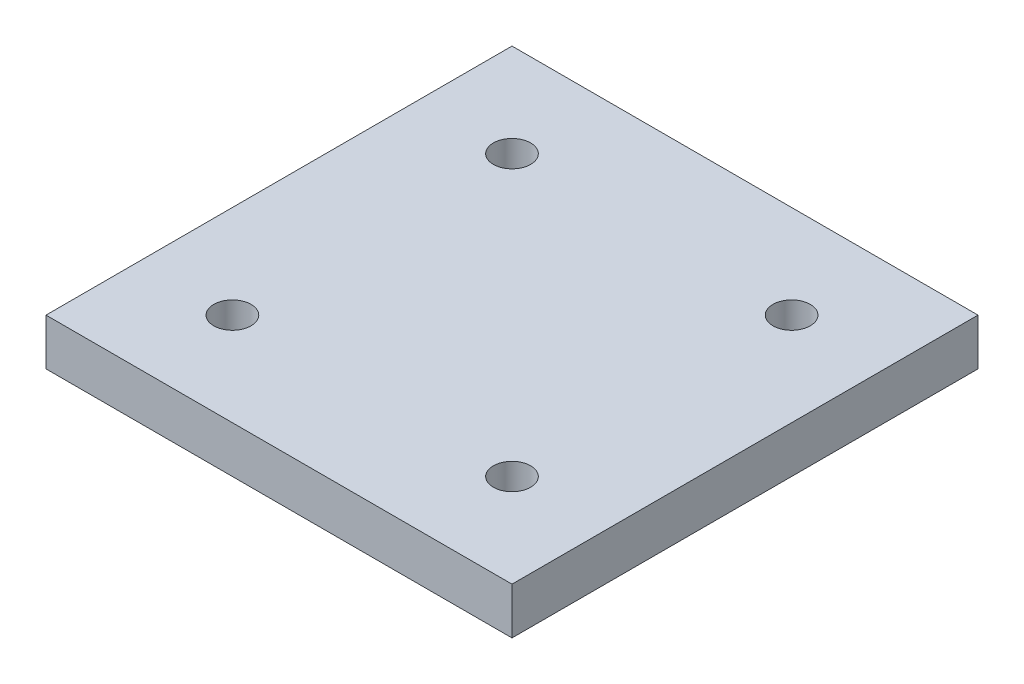
ISO-10303-21;
HEADER;
FILE_DESCRIPTION(('STEP AP214'),'2;1');
FILE_NAME('part.step','',(''),(''),'','','');
FILE_SCHEMA(('AUTOMOTIVE_DESIGN { 1 0 10303 214 1 1 1 1 }'));
ENDSEC;
DATA;
#1=APPLICATION_CONTEXT('core data for automotive mechanical design processes');
#2=APPLICATION_PROTOCOL_DEFINITION('international standard','automotive_design',2000,#1);
#3=PRODUCT_CONTEXT('',#1,'mechanical');
#4=PRODUCT('Part','Part','',(#3));
#5=PRODUCT_RELATED_PRODUCT_CATEGORY('part','',(#4));
#6=PRODUCT_DEFINITION_FORMATION('','',#4);
#7=PRODUCT_DEFINITION_CONTEXT('part definition',#1,'design');
#8=PRODUCT_DEFINITION('design','',#6,#7);
#9=PRODUCT_DEFINITION_SHAPE('','',#8);
#10=(LENGTH_UNIT() NAMED_UNIT(*) SI_UNIT(.MILLI.,.METRE.));
#11=(NAMED_UNIT(*) PLANE_ANGLE_UNIT() SI_UNIT($,.RADIAN.));
#12=(NAMED_UNIT(*) SI_UNIT($,.STERADIAN.) SOLID_ANGLE_UNIT());
#13=UNCERTAINTY_MEASURE_WITH_UNIT(LENGTH_MEASURE(1.E-05),#10,'distance_accuracy_value','');
#14=(GEOMETRIC_REPRESENTATION_CONTEXT(3) GLOBAL_UNCERTAINTY_ASSIGNED_CONTEXT((#13)) GLOBAL_UNIT_ASSIGNED_CONTEXT((#10,
#11,#12)) REPRESENTATION_CONTEXT('',''));
#15=CARTESIAN_POINT('',(0.,0.,0.));
#16=DIRECTION('',(0.,0.,1.));
#17=DIRECTION('',(1.,0.,0.));
#18=AXIS2_PLACEMENT_3D('',#15,#16,#17);
#19=CARTESIAN_POINT('',(-50.,10.,50.));
#20=DIRECTION('',(1.,0.,0.));
#21=DIRECTION('',(0.,0.,-1.));
#22=AXIS2_PLACEMENT_3D('',#19,#20,#21);
#23=PLANE('',#22);
#24=DIRECTION('',(0.,0.,1.));
#25=VECTOR('',#24,1.);
#26=CARTESIAN_POINT('',(-50.,0.,50.));
#27=LINE('',#26,#25);
#28=CARTESIAN_POINT('',(-50.,0.,-50.));
#29=VERTEX_POINT('',#28);
#30=CARTESIAN_POINT('',(-50.,0.,50.));
#31=VERTEX_POINT('',#30);
#32=EDGE_CURVE('E97',#29,#31,#27,.T.);
#33=ORIENTED_EDGE('',*,*,#32,.T.);
#34=DIRECTION('',(0.,-1.,0.));
#35=VECTOR('',#34,1.);
#36=CARTESIAN_POINT('',(-50.,10.,50.));
#37=LINE('',#36,#35);
#38=CARTESIAN_POINT('',(-50.,10.,50.));
#39=VERTEX_POINT('',#38);
#40=EDGE_CURVE('E11',#39,#31,#37,.T.);
#41=ORIENTED_EDGE('',*,*,#40,.F.);
#42=DIRECTION('',(0.,0.,1.));
#43=VECTOR('',#42,1.);
#44=CARTESIAN_POINT('',(-50.,10.,50.));
#45=LINE('',#44,#43);
#46=CARTESIAN_POINT('',(-50.,10.,-50.));
#47=VERTEX_POINT('',#46);
#48=EDGE_CURVE('E85',#47,#39,#45,.T.);
#49=ORIENTED_EDGE('',*,*,#48,.F.);
#50=DIRECTION('',(0.,-1.,0.));
#51=VECTOR('',#50,1.);
#52=CARTESIAN_POINT('',(-50.,10.,-50.));
#53=LINE('',#52,#51);
#54=EDGE_CURVE('E93',#47,#29,#53,.T.);
#55=ORIENTED_EDGE('',*,*,#54,.T.);
#56=EDGE_LOOP('',(#33,#41,#49,#55));
#57=FACE_BOUND('',#56,.T.);
#58=ADVANCED_FACE('F34',(#57),#23,.F.);
#59=CARTESIAN_POINT('',(-50.,10.,50.));
#60=DIRECTION('',(0.,0.,-1.));
#61=DIRECTION('',(-1.,0.,0.));
#62=AXIS2_PLACEMENT_3D('',#59,#60,#61);
#63=PLANE('',#62);
#64=DIRECTION('',(1.,0.,0.));
#65=VECTOR('',#64,1.);
#66=CARTESIAN_POINT('',(-50.,0.,50.));
#67=LINE('',#66,#65);
#68=CARTESIAN_POINT('',(50.,0.,50.));
#69=VERTEX_POINT('',#68);
#70=EDGE_CURVE('E89',#31,#69,#67,.T.);
#71=ORIENTED_EDGE('',*,*,#70,.T.);
#72=DIRECTION('',(0.,-1.,0.));
#73=VECTOR('',#72,1.);
#74=CARTESIAN_POINT('',(50.,10.,50.));
#75=LINE('',#74,#73);
#76=CARTESIAN_POINT('',(50.,10.,50.));
#77=VERTEX_POINT('',#76);
#78=EDGE_CURVE('E42',#77,#69,#75,.T.);
#79=ORIENTED_EDGE('',*,*,#78,.F.);
#80=DIRECTION('',(1.,0.,0.));
#81=VECTOR('',#80,1.);
#82=CARTESIAN_POINT('',(-50.,10.,50.));
#83=LINE('',#82,#81);
#84=EDGE_CURVE('E80',#39,#77,#83,.T.);
#85=ORIENTED_EDGE('',*,*,#84,.F.);
#86=ORIENTED_EDGE('',*,*,#40,.T.);
#87=EDGE_LOOP('',(#71,#79,#85,#86));
#88=FACE_BOUND('',#87,.T.);
#89=ADVANCED_FACE('F88',(#88),#63,.F.);
#90=CARTESIAN_POINT('',(50.,10.,50.));
#91=DIRECTION('',(-1.,0.,0.));
#92=DIRECTION('',(0.,0.,1.));
#93=AXIS2_PLACEMENT_3D('',#90,#91,#92);
#94=PLANE('',#93);
#95=DIRECTION('',(0.,0.,-1.));
#96=VECTOR('',#95,1.);
#97=CARTESIAN_POINT('',(50.,0.,50.));
#98=LINE('',#97,#96);
#99=CARTESIAN_POINT('',(50.,0.,-50.));
#100=VERTEX_POINT('',#99);
#101=EDGE_CURVE('E67',#69,#100,#98,.T.);
#102=ORIENTED_EDGE('',*,*,#101,.T.);
#103=DIRECTION('',(0.,-1.,0.));
#104=VECTOR('',#103,1.);
#105=CARTESIAN_POINT('',(50.,10.,-50.));
#106=LINE('',#105,#104);
#107=CARTESIAN_POINT('',(50.,10.,-50.));
#108=VERTEX_POINT('',#107);
#109=EDGE_CURVE('E90',#108,#100,#106,.T.);
#110=ORIENTED_EDGE('',*,*,#109,.F.);
#111=DIRECTION('',(0.,0.,-1.));
#112=VECTOR('',#111,1.);
#113=CARTESIAN_POINT('',(50.,10.,50.));
#114=LINE('',#113,#112);
#115=EDGE_CURVE('E83',#77,#108,#114,.T.);
#116=ORIENTED_EDGE('',*,*,#115,.F.);
#117=ORIENTED_EDGE('',*,*,#78,.T.);
#118=EDGE_LOOP('',(#102,#110,#116,#117));
#119=FACE_BOUND('',#118,.T.);
#120=ADVANCED_FACE('F91',(#119),#94,.F.);
#121=CARTESIAN_POINT('',(-50.,10.,-50.));
#122=DIRECTION('',(0.,0.,1.));
#123=DIRECTION('',(1.,0.,0.));
#124=AXIS2_PLACEMENT_3D('',#121,#122,#123);
#125=PLANE('',#124);
#126=DIRECTION('',(-1.,0.,0.));
#127=VECTOR('',#126,1.);
#128=CARTESIAN_POINT('',(-50.,0.,-50.));
#129=LINE('',#128,#127);
#130=EDGE_CURVE('E73',#100,#29,#129,.T.);
#131=ORIENTED_EDGE('',*,*,#130,.T.);
#132=ORIENTED_EDGE('',*,*,#54,.F.);
#133=DIRECTION('',(-1.,0.,0.));
#134=VECTOR('',#133,1.);
#135=CARTESIAN_POINT('',(-50.,10.,-50.));
#136=LINE('',#135,#134);
#137=EDGE_CURVE('E50',#108,#47,#136,.T.);
#138=ORIENTED_EDGE('',*,*,#137,.F.);
#139=ORIENTED_EDGE('',*,*,#109,.T.);
#140=EDGE_LOOP('',(#131,#132,#138,#139));
#141=FACE_BOUND('',#140,.T.);
#142=ADVANCED_FACE('F105',(#141),#125,.F.);
#143=CARTESIAN_POINT('',(0.,10.,0.));
#144=DIRECTION('',(0.,-1.,0.));
#145=DIRECTION('',(0.,0.,-1.));
#146=AXIS2_PLACEMENT_3D('',#143,#144,#145);
#147=PLANE('',#146);
#148=CARTESIAN_POINT('',(29.9999999999997,10.,30.0000000000003));
#149=DIRECTION('',(0.,1.,0.));
#150=DIRECTION('',(0.,0.,1.));
#151=AXIS2_PLACEMENT_3D('',#148,#149,#150);
#152=CIRCLE('',#151,4.00000000000001);
#153=CARTESIAN_POINT('',(29.9999999999997,10.,34.0000000000003));
#154=VERTEX_POINT('',#153);
#155=EDGE_CURVE('E129',#154,#154,#152,.T.);
#156=ORIENTED_EDGE('',*,*,#155,.F.);
#157=EDGE_LOOP('',(#156));
#158=FACE_BOUND('',#157,.T.);
#159=CARTESIAN_POINT('',(-30.,10.,30.));
#160=DIRECTION('',(0.,1.,0.));
#161=DIRECTION('',(0.,0.,1.));
#162=AXIS2_PLACEMENT_3D('',#159,#160,#161);
#163=CIRCLE('',#162,4.00000000000001);
#164=CARTESIAN_POINT('',(-30.,10.,34.));
#165=VERTEX_POINT('',#164);
#166=EDGE_CURVE('E123',#165,#165,#163,.T.);
#167=ORIENTED_EDGE('',*,*,#166,.F.);
#168=EDGE_LOOP('',(#167));
#169=FACE_BOUND('',#168,.T.);
#170=CARTESIAN_POINT('',(30.0000000000002,10.,-29.9999999999998));
#171=DIRECTION('',(0.,1.,0.));
#172=DIRECTION('',(0.,0.,1.));
#173=AXIS2_PLACEMENT_3D('',#170,#171,#172);
#174=CIRCLE('',#173,4.00000000000001);
#175=CARTESIAN_POINT('',(30.0000000000002,10.,-25.9999999999998));
#176=VERTEX_POINT('',#175);
#177=EDGE_CURVE('E117',#176,#176,#174,.T.);
#178=ORIENTED_EDGE('',*,*,#177,.F.);
#179=EDGE_LOOP('',(#178));
#180=FACE_BOUND('',#179,.T.);
#181=CARTESIAN_POINT('',(-29.9999999999999,10.,-30.0000000000001));
#182=DIRECTION('',(0.,1.,0.));
#183=DIRECTION('',(0.,0.,1.));
#184=AXIS2_PLACEMENT_3D('',#181,#182,#183);
#185=CIRCLE('',#184,4.00000000000001);
#186=CARTESIAN_POINT('',(-29.9999999999999,10.,-26.0000000000001));
#187=VERTEX_POINT('',#186);
#188=EDGE_CURVE('E111',#187,#187,#185,.T.);
#189=ORIENTED_EDGE('',*,*,#188,.F.);
#190=EDGE_LOOP('',(#189));
#191=FACE_BOUND('',#190,.T.);
#192=ORIENTED_EDGE('',*,*,#48,.T.);
#193=ORIENTED_EDGE('',*,*,#84,.T.);
#194=ORIENTED_EDGE('',*,*,#115,.T.);
#195=ORIENTED_EDGE('',*,*,#137,.T.);
#196=EDGE_LOOP('',(#192,#193,#194,#195));
#197=FACE_BOUND('',#196,.T.);
#198=ADVANCED_FACE('F81',(#158,#169,#180,#191,#197),#147,.F.);
#199=CARTESIAN_POINT('',(0.,0.,0.));
#200=DIRECTION('',(0.,-1.,0.));
#201=DIRECTION('',(0.,0.,-1.));
#202=AXIS2_PLACEMENT_3D('',#199,#200,#201);
#203=PLANE('',#202);
#204=CARTESIAN_POINT('',(29.9999999999997,0.,30.0000000000003));
#205=DIRECTION('',(0.,1.,0.));
#206=DIRECTION('',(0.,0.,1.));
#207=AXIS2_PLACEMENT_3D('',#204,#205,#206);
#208=CIRCLE('',#207,4.00000000000001);
#209=CARTESIAN_POINT('',(29.9999999999997,0.,34.0000000000003));
#210=VERTEX_POINT('',#209);
#211=EDGE_CURVE('E126',#210,#210,#208,.T.);
#212=ORIENTED_EDGE('',*,*,#211,.T.);
#213=EDGE_LOOP('',(#212));
#214=FACE_BOUND('',#213,.T.);
#215=CARTESIAN_POINT('',(-30.,0.,30.));
#216=DIRECTION('',(0.,1.,0.));
#217=DIRECTION('',(0.,0.,1.));
#218=AXIS2_PLACEMENT_3D('',#215,#216,#217);
#219=CIRCLE('',#218,4.00000000000001);
#220=CARTESIAN_POINT('',(-30.,0.,34.));
#221=VERTEX_POINT('',#220);
#222=EDGE_CURVE('E120',#221,#221,#219,.T.);
#223=ORIENTED_EDGE('',*,*,#222,.T.);
#224=EDGE_LOOP('',(#223));
#225=FACE_BOUND('',#224,.T.);
#226=CARTESIAN_POINT('',(30.0000000000002,0.,-29.9999999999998));
#227=DIRECTION('',(0.,1.,0.));
#228=DIRECTION('',(0.,0.,1.));
#229=AXIS2_PLACEMENT_3D('',#226,#227,#228);
#230=CIRCLE('',#229,4.00000000000001);
#231=CARTESIAN_POINT('',(30.0000000000002,0.,-25.9999999999998));
#232=VERTEX_POINT('',#231);
#233=EDGE_CURVE('E114',#232,#232,#230,.T.);
#234=ORIENTED_EDGE('',*,*,#233,.T.);
#235=EDGE_LOOP('',(#234));
#236=FACE_BOUND('',#235,.T.);
#237=CARTESIAN_POINT('',(-29.9999999999999,0.,-30.0000000000001));
#238=DIRECTION('',(0.,1.,0.));
#239=DIRECTION('',(0.,0.,1.));
#240=AXIS2_PLACEMENT_3D('',#237,#238,#239);
#241=CIRCLE('',#240,4.00000000000001);
#242=CARTESIAN_POINT('',(-29.9999999999999,0.,-26.0000000000001));
#243=VERTEX_POINT('',#242);
#244=EDGE_CURVE('E100',#243,#243,#241,.T.);
#245=ORIENTED_EDGE('',*,*,#244,.T.);
#246=EDGE_LOOP('',(#245));
#247=FACE_BOUND('',#246,.T.);
#248=ORIENTED_EDGE('',*,*,#32,.F.);
#249=ORIENTED_EDGE('',*,*,#130,.F.);
#250=ORIENTED_EDGE('',*,*,#101,.F.);
#251=ORIENTED_EDGE('',*,*,#70,.F.);
#252=EDGE_LOOP('',(#248,#249,#250,#251));
#253=FACE_BOUND('',#252,.T.);
#254=ADVANCED_FACE('F108',(#214,#225,#236,#247,#253),#203,.T.);
#255=CARTESIAN_POINT('',(-29.9999999999999,0.,-30.0000000000001));
#256=DIRECTION('',(0.,1.,0.));
#257=DIRECTION('',(0.,0.,1.));
#258=AXIS2_PLACEMENT_3D('',#255,#256,#257);
#259=CYLINDRICAL_SURFACE('',#258,4.00000000000001);
#260=ORIENTED_EDGE('',*,*,#244,.F.);
#261=EDGE_LOOP('',(#260));
#262=FACE_BOUND('',#261,.T.);
#263=ORIENTED_EDGE('',*,*,#188,.T.);
#264=EDGE_LOOP('',(#263));
#265=FACE_BOUND('',#264,.T.);
#266=ADVANCED_FACE('F153',(#262,#265),#259,.F.);
#267=CARTESIAN_POINT('',(30.0000000000002,0.,-29.9999999999998));
#268=DIRECTION('',(0.,1.,0.));
#269=DIRECTION('',(0.,0.,1.));
#270=AXIS2_PLACEMENT_3D('',#267,#268,#269);
#271=CYLINDRICAL_SURFACE('',#270,4.00000000000001);
#272=ORIENTED_EDGE('',*,*,#233,.F.);
#273=EDGE_LOOP('',(#272));
#274=FACE_BOUND('',#273,.T.);
#275=ORIENTED_EDGE('',*,*,#177,.T.);
#276=EDGE_LOOP('',(#275));
#277=FACE_BOUND('',#276,.T.);
#278=ADVANCED_FACE('F155',(#274,#277),#271,.F.);
#279=CARTESIAN_POINT('',(-30.,0.,30.));
#280=DIRECTION('',(0.,1.,0.));
#281=DIRECTION('',(0.,0.,1.));
#282=AXIS2_PLACEMENT_3D('',#279,#280,#281);
#283=CYLINDRICAL_SURFACE('',#282,4.00000000000001);
#284=ORIENTED_EDGE('',*,*,#222,.F.);
#285=EDGE_LOOP('',(#284));
#286=FACE_BOUND('',#285,.T.);
#287=ORIENTED_EDGE('',*,*,#166,.T.);
#288=EDGE_LOOP('',(#287));
#289=FACE_BOUND('',#288,.T.);
#290=ADVANCED_FACE('F140',(#286,#289),#283,.F.);
#291=CARTESIAN_POINT('',(29.9999999999997,0.,30.0000000000003));
#292=DIRECTION('',(0.,1.,0.));
#293=DIRECTION('',(0.,0.,1.));
#294=AXIS2_PLACEMENT_3D('',#291,#292,#293);
#295=CYLINDRICAL_SURFACE('',#294,4.00000000000001);
#296=ORIENTED_EDGE('',*,*,#211,.F.);
#297=EDGE_LOOP('',(#296));
#298=FACE_BOUND('',#297,.T.);
#299=ORIENTED_EDGE('',*,*,#155,.T.);
#300=EDGE_LOOP('',(#299));
#301=FACE_BOUND('',#300,.T.);
#302=ADVANCED_FACE('F137',(#298,#301),#295,.F.);
#303=CLOSED_SHELL('',(#58,#89,#120,#142,#198,#254,#266,#278,#290,#302));
#304=MANIFOLD_SOLID_BREP('B2',#303);
#305=ADVANCED_BREP_SHAPE_REPRESENTATION('',(#18,#304),#14);
#306=SHAPE_DEFINITION_REPRESENTATION(#9,#305);
ENDSEC;
END-ISO-10303-21;
